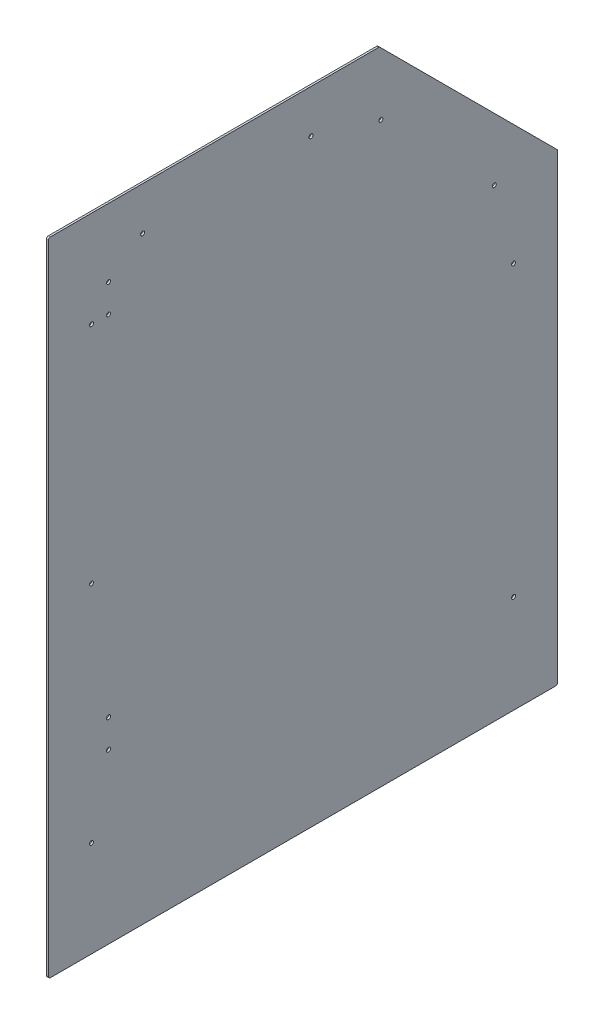
ISO-10303-21;
HEADER;
FILE_DESCRIPTION(('STEP AP214'),'2;1');
FILE_NAME('part.step','',(''),(''),'','','');
FILE_SCHEMA(('AUTOMOTIVE_DESIGN { 1 0 10303 214 1 1 1 1 }'));
ENDSEC;
DATA;
#1=APPLICATION_CONTEXT('core data for automotive mechanical design processes');
#2=APPLICATION_PROTOCOL_DEFINITION('international standard','automotive_design',2000,#1);
#3=PRODUCT_CONTEXT('',#1,'mechanical');
#4=PRODUCT('Part','Part','',(#3));
#5=PRODUCT_RELATED_PRODUCT_CATEGORY('part','',(#4));
#6=PRODUCT_DEFINITION_FORMATION('','',#4);
#7=PRODUCT_DEFINITION_CONTEXT('part definition',#1,'design');
#8=PRODUCT_DEFINITION('design','',#6,#7);
#9=PRODUCT_DEFINITION_SHAPE('','',#8);
#10=(LENGTH_UNIT() NAMED_UNIT(*) SI_UNIT(.MILLI.,.METRE.));
#11=(NAMED_UNIT(*) PLANE_ANGLE_UNIT() SI_UNIT($,.RADIAN.));
#12=(NAMED_UNIT(*) SI_UNIT($,.STERADIAN.) SOLID_ANGLE_UNIT());
#13=UNCERTAINTY_MEASURE_WITH_UNIT(LENGTH_MEASURE(1.E-05),#10,'distance_accuracy_value','');
#14=(GEOMETRIC_REPRESENTATION_CONTEXT(3) GLOBAL_UNCERTAINTY_ASSIGNED_CONTEXT((#13)) GLOBAL_UNIT_ASSIGNED_CONTEXT((#10,
#11,#12)) REPRESENTATION_CONTEXT('',''));
#15=CARTESIAN_POINT('',(0.,0.,0.));
#16=DIRECTION('',(0.,0.,1.));
#17=DIRECTION('',(1.,0.,0.));
#18=AXIS2_PLACEMENT_3D('',#15,#16,#17);
#19=CARTESIAN_POINT('',(0.,0.,0.));
#20=DIRECTION('',(-1.,0.,0.));
#21=DIRECTION('',(0.,0.,1.));
#22=AXIS2_PLACEMENT_3D('',#19,#20,#21);
#23=PLANE('',#22);
#24=CARTESIAN_POINT('',(0.,152.4,-68.2625000000001));
#25=DIRECTION('',(1.,0.,0.));
#26=DIRECTION('',(0.,0.,-1.));
#27=AXIS2_PLACEMENT_3D('',#24,#25,#26);
#28=CIRCLE('',#27,3.17499999999998);
#29=CARTESIAN_POINT('',(0.,152.4,-71.4375000000001));
#30=VERTEX_POINT('',#29);
#31=EDGE_CURVE('E283',#30,#30,#28,.T.);
#32=ORIENTED_EDGE('',*,*,#31,.T.);
#33=EDGE_LOOP('',(#32));
#34=FACE_BOUND('',#33,.T.);
#35=CARTESIAN_POINT('',(0.,508.,-68.2625000000001));
#36=DIRECTION('',(1.,0.,0.));
#37=DIRECTION('',(0.,0.,-1.));
#38=AXIS2_PLACEMENT_3D('',#35,#36,#37);
#39=CIRCLE('',#38,3.17500000000004);
#40=CARTESIAN_POINT('',(0.,508.,-71.4375000000002));
#41=VERTEX_POINT('',#40);
#42=EDGE_CURVE('E277',#41,#41,#39,.T.);
#43=ORIENTED_EDGE('',*,*,#42,.T.);
#44=EDGE_LOOP('',(#43));
#45=FACE_BOUND('',#44,.T.);
#46=CARTESIAN_POINT('',(0.,863.6,-68.2625000000001));
#47=DIRECTION('',(1.,0.,0.));
#48=DIRECTION('',(0.,0.,-1.));
#49=AXIS2_PLACEMENT_3D('',#46,#47,#48);
#50=CIRCLE('',#49,3.17500000000004);
#51=CARTESIAN_POINT('',(0.,863.6,-71.4375000000002));
#52=VERTEX_POINT('',#51);
#53=EDGE_CURVE('E271',#52,#52,#50,.T.);
#54=ORIENTED_EDGE('',*,*,#53,.T.);
#55=EDGE_LOOP('',(#54));
#56=FACE_BOUND('',#55,.T.);
#57=CARTESIAN_POINT('',(0.,947.7375,-149.225));
#58=DIRECTION('',(1.,0.,0.));
#59=DIRECTION('',(0.,0.,-1.));
#60=AXIS2_PLACEMENT_3D('',#57,#58,#59);
#61=CIRCLE('',#60,3.17500000000004);
#62=CARTESIAN_POINT('',(0.,947.7375,-152.4));
#63=VERTEX_POINT('',#62);
#64=EDGE_CURVE('E265',#63,#63,#61,.T.);
#65=ORIENTED_EDGE('',*,*,#64,.T.);
#66=EDGE_LOOP('',(#65));
#67=FACE_BOUND('',#66,.T.);
#68=DIRECTION('',(0.,-1.,0.));
#69=VECTOR('',#68,1.);
#70=CARTESIAN_POINT('',(0.,0.,0.));
#71=LINE('',#70,#69);
#72=CARTESIAN_POINT('',(0.,1012.825,0.));
#73=VERTEX_POINT('',#72);
#74=CARTESIAN_POINT('',(0.,3.175,0.));
#75=VERTEX_POINT('',#74);
#76=EDGE_CURVE('E130',#73,#75,#71,.T.);
#77=ORIENTED_EDGE('',*,*,#76,.F.);
#78=CARTESIAN_POINT('',(0.,1012.825,-3.175));
#79=DIRECTION('',(-1.,0.,0.));
#80=DIRECTION('',(0.,0.,1.));
#81=AXIS2_PLACEMENT_3D('',#78,#79,#80);
#82=CIRCLE('',#81,3.175);
#83=CARTESIAN_POINT('',(0.,1016.,-3.175));
#84=VERTEX_POINT('',#83);
#85=EDGE_CURVE('E113',#73,#84,#82,.T.);
#86=ORIENTED_EDGE('',*,*,#85,.T.);
#87=DIRECTION('',(0.,0.,1.));
#88=VECTOR('',#87,1.);
#89=CARTESIAN_POINT('',(0.,1016.,0.));
#90=LINE('',#89,#88);
#91=CARTESIAN_POINT('',(0.,1016.,-522.917689271223));
#92=VERTEX_POINT('',#91);
#93=EDGE_CURVE('E140',#92,#84,#90,.T.);
#94=ORIENTED_EDGE('',*,*,#93,.F.);
#95=CARTESIAN_POINT('',(0.,1012.825,-522.917689271223));
#96=DIRECTION('',(-1.,0.,0.));
#97=DIRECTION('',(0.,0.,1.));
#98=AXIS2_PLACEMENT_3D('',#95,#96,#97);
#99=CIRCLE('',#98,3.175);
#100=CARTESIAN_POINT('',(0.,1015.07006403027,-525.16275330149));
#101=VERTEX_POINT('',#100);
#102=EDGE_CURVE('E124',#92,#101,#99,.T.);
#103=ORIENTED_EDGE('',*,*,#102,.T.);
#104=DIRECTION('',(0.,0.707106781186544,0.707106781186552));
#105=VECTOR('',#104,1.);
#106=CARTESIAN_POINT('',(0.,1016.,-524.232817331758));
#107=LINE('',#106,#105);
#108=CARTESIAN_POINT('',(0.,734.712753301493,-805.520064030267));
#109=VERTEX_POINT('',#108);
#110=EDGE_CURVE('E145',#109,#101,#107,.T.);
#111=ORIENTED_EDGE('',*,*,#110,.F.);
#112=CARTESIAN_POINT('',(0.,732.467689271226,-803.275));
#113=DIRECTION('',(-1.,0.,0.));
#114=DIRECTION('',(0.,0.,1.));
#115=AXIS2_PLACEMENT_3D('',#112,#113,#114);
#116=CIRCLE('',#115,3.175);
#117=CARTESIAN_POINT('',(0.,732.467689271226,-806.45));
#118=VERTEX_POINT('',#117);
#119=EDGE_CURVE('E153',#109,#118,#116,.T.);
#120=ORIENTED_EDGE('',*,*,#119,.T.);
#121=DIRECTION('',(0.,1.,0.));
#122=VECTOR('',#121,1.);
#123=CARTESIAN_POINT('',(0.,733.782817331761,-806.45));
#124=LINE('',#123,#122);
#125=CARTESIAN_POINT('',(0.,3.17500000000004,-806.45));
#126=VERTEX_POINT('',#125);
#127=EDGE_CURVE('E187',#126,#118,#124,.T.);
#128=ORIENTED_EDGE('',*,*,#127,.F.);
#129=CARTESIAN_POINT('',(0.,3.17500000000004,-803.275));
#130=DIRECTION('',(-1.,0.,0.));
#131=DIRECTION('',(0.,0.,1.));
#132=AXIS2_PLACEMENT_3D('',#129,#130,#131);
#133=CIRCLE('',#132,3.175);
#134=CARTESIAN_POINT('',(0.,0.,-803.275));
#135=VERTEX_POINT('',#134);
#136=EDGE_CURVE('E151',#126,#135,#133,.T.);
#137=ORIENTED_EDGE('',*,*,#136,.T.);
#138=DIRECTION('',(0.,0.,-1.));
#139=VECTOR('',#138,1.);
#140=CARTESIAN_POINT('',(0.,0.,-806.45));
#141=LINE('',#140,#139);
#142=CARTESIAN_POINT('',(0.,0.,-3.17500000000004));
#143=VERTEX_POINT('',#142);
#144=EDGE_CURVE('E182',#143,#135,#141,.T.);
#145=ORIENTED_EDGE('',*,*,#144,.F.);
#146=CARTESIAN_POINT('',(0.,3.175,-3.17500000000004));
#147=DIRECTION('',(-1.,0.,0.));
#148=DIRECTION('',(0.,0.,1.));
#149=AXIS2_PLACEMENT_3D('',#146,#147,#148);
#150=CIRCLE('',#149,3.175);
#151=EDGE_CURVE('E134',#143,#75,#150,.T.);
#152=ORIENTED_EDGE('',*,*,#151,.T.);
#153=EDGE_LOOP('',(#77,#86,#94,#103,#111,#120,#128,#137,#145,#152));
#154=FACE_BOUND('',#153,.T.);
#155=CARTESIAN_POINT('',(0.,908.05,-95.2499999999979));
#156=DIRECTION('',(1.,0.,0.));
#157=DIRECTION('',(0.,0.,-1.));
#158=AXIS2_PLACEMENT_3D('',#155,#156,#157);
#159=CIRCLE('',#158,3.17500000000004);
#160=CARTESIAN_POINT('',(0.,908.05,-98.424999999998));
#161=VERTEX_POINT('',#160);
#162=EDGE_CURVE('E188',#161,#161,#159,.T.);
#163=ORIENTED_EDGE('',*,*,#162,.T.);
#164=EDGE_LOOP('',(#163));
#165=FACE_BOUND('',#164,.T.);
#166=CARTESIAN_POINT('',(0.,863.6,-95.2499999999997));
#167=DIRECTION('',(1.,0.,0.));
#168=DIRECTION('',(0.,0.,-1.));
#169=AXIS2_PLACEMENT_3D('',#166,#167,#168);
#170=CIRCLE('',#169,3.17500000000004);
#171=CARTESIAN_POINT('',(0.,863.6,-98.4249999999997));
#172=VERTEX_POINT('',#171);
#173=EDGE_CURVE('E217',#172,#172,#170,.T.);
#174=ORIENTED_EDGE('',*,*,#173,.T.);
#175=EDGE_LOOP('',(#174));
#176=FACE_BOUND('',#175,.T.);
#177=CARTESIAN_POINT('',(0.,311.15,-95.25));
#178=DIRECTION('',(1.,0.,0.));
#179=DIRECTION('',(0.,0.,-1.));
#180=AXIS2_PLACEMENT_3D('',#177,#178,#179);
#181=CIRCLE('',#180,3.17499999999998);
#182=CARTESIAN_POINT('',(0.,311.15,-98.425));
#183=VERTEX_POINT('',#182);
#184=EDGE_CURVE('E223',#183,#183,#181,.T.);
#185=ORIENTED_EDGE('',*,*,#184,.T.);
#186=EDGE_LOOP('',(#185));
#187=FACE_BOUND('',#186,.T.);
#188=CARTESIAN_POINT('',(0.,266.7,-95.25));
#189=DIRECTION('',(1.,0.,0.));
#190=DIRECTION('',(0.,0.,-1.));
#191=AXIS2_PLACEMENT_3D('',#188,#189,#190);
#192=CIRCLE('',#191,3.17499999999998);
#193=CARTESIAN_POINT('',(0.,266.7,-98.425));
#194=VERTEX_POINT('',#193);
#195=EDGE_CURVE('E229',#194,#194,#192,.T.);
#196=ORIENTED_EDGE('',*,*,#195,.T.);
#197=EDGE_LOOP('',(#196));
#198=FACE_BOUND('',#197,.T.);
#199=CARTESIAN_POINT('',(0.,914.924172517765,-526.525827482232));
#200=DIRECTION('',(1.,0.,0.));
#201=DIRECTION('',(0.,0.,-1.));
#202=AXIS2_PLACEMENT_3D('',#199,#200,#201);
#203=CIRCLE('',#202,3.17500000000004);
#204=CARTESIAN_POINT('',(0.,914.924172517765,-529.700827482232));
#205=VERTEX_POINT('',#204);
#206=EDGE_CURVE('E235',#205,#205,#203,.T.);
#207=ORIENTED_EDGE('',*,*,#206,.T.);
#208=EDGE_LOOP('',(#207));
#209=FACE_BOUND('',#208,.T.);
#210=CARTESIAN_POINT('',(0.,735.319050096383,-706.130949903616));
#211=DIRECTION('',(1.,0.,0.));
#212=DIRECTION('',(0.,0.,-1.));
#213=AXIS2_PLACEMENT_3D('',#210,#211,#212);
#214=CIRCLE('',#213,3.17500000000004);
#215=CARTESIAN_POINT('',(0.,735.319050096383,-709.305949903616));
#216=VERTEX_POINT('',#215);
#217=EDGE_CURVE('E241',#216,#216,#214,.T.);
#218=ORIENTED_EDGE('',*,*,#217,.T.);
#219=EDGE_LOOP('',(#218));
#220=FACE_BOUND('',#219,.T.);
#221=CARTESIAN_POINT('',(0.,612.775,-736.6));
#222=DIRECTION('',(1.,0.,0.));
#223=DIRECTION('',(0.,0.,-1.));
#224=AXIS2_PLACEMENT_3D('',#221,#222,#223);
#225=CIRCLE('',#224,3.17500000000004);
#226=CARTESIAN_POINT('',(0.,612.775,-739.775));
#227=VERTEX_POINT('',#226);
#228=EDGE_CURVE('E247',#227,#227,#225,.T.);
#229=ORIENTED_EDGE('',*,*,#228,.T.);
#230=EDGE_LOOP('',(#229));
#231=FACE_BOUND('',#230,.T.);
#232=CARTESIAN_POINT('',(0.,155.575,-736.6));
#233=DIRECTION('',(1.,0.,0.));
#234=DIRECTION('',(0.,0.,-1.));
#235=AXIS2_PLACEMENT_3D('',#232,#233,#234);
#236=CIRCLE('',#235,3.17499999999998);
#237=CARTESIAN_POINT('',(0.,155.575,-739.775));
#238=VERTEX_POINT('',#237);
#239=EDGE_CURVE('E253',#238,#238,#236,.T.);
#240=ORIENTED_EDGE('',*,*,#239,.T.);
#241=EDGE_LOOP('',(#240));
#242=FACE_BOUND('',#241,.T.);
#243=CARTESIAN_POINT('',(0.,947.7375,-415.925));
#244=DIRECTION('',(1.,0.,0.));
#245=DIRECTION('',(0.,0.,-1.));
#246=AXIS2_PLACEMENT_3D('',#243,#244,#245);
#247=CIRCLE('',#246,3.17500000000004);
#248=CARTESIAN_POINT('',(0.,947.7375,-419.1));
#249=VERTEX_POINT('',#248);
#250=EDGE_CURVE('E259',#249,#249,#247,.T.);
#251=ORIENTED_EDGE('',*,*,#250,.T.);
#252=EDGE_LOOP('',(#251));
#253=FACE_BOUND('',#252,.T.);
#254=ADVANCED_FACE('F35',(#34,#45,#56,#67,#154,#165,#176,#187,#198,#209,#220,#231,#242,#253),
#23,.T.);
#255=CARTESIAN_POINT('',(3.175,0.,0.));
#256=DIRECTION('',(-1.,0.,0.));
#257=DIRECTION('',(0.,0.,1.));
#258=AXIS2_PLACEMENT_3D('',#255,#256,#257);
#259=PLANE('',#258);
#260=CARTESIAN_POINT('',(3.175,152.4,-68.2625000000001));
#261=DIRECTION('',(1.,0.,0.));
#262=DIRECTION('',(0.,0.,-1.));
#263=AXIS2_PLACEMENT_3D('',#260,#261,#262);
#264=CIRCLE('',#263,3.17499999999998);
#265=CARTESIAN_POINT('',(3.175,152.4,-71.4375000000001));
#266=VERTEX_POINT('',#265);
#267=EDGE_CURVE('E286',#266,#266,#264,.T.);
#268=ORIENTED_EDGE('',*,*,#267,.F.);
#269=EDGE_LOOP('',(#268));
#270=FACE_BOUND('',#269,.T.);
#271=CARTESIAN_POINT('',(3.175,508.,-68.2625000000001));
#272=DIRECTION('',(1.,0.,0.));
#273=DIRECTION('',(0.,0.,-1.));
#274=AXIS2_PLACEMENT_3D('',#271,#272,#273);
#275=CIRCLE('',#274,3.17500000000004);
#276=CARTESIAN_POINT('',(3.175,508.,-71.4375000000002));
#277=VERTEX_POINT('',#276);
#278=EDGE_CURVE('E280',#277,#277,#275,.T.);
#279=ORIENTED_EDGE('',*,*,#278,.F.);
#280=EDGE_LOOP('',(#279));
#281=FACE_BOUND('',#280,.T.);
#282=CARTESIAN_POINT('',(3.175,863.6,-68.2625000000001));
#283=DIRECTION('',(1.,0.,0.));
#284=DIRECTION('',(0.,0.,-1.));
#285=AXIS2_PLACEMENT_3D('',#282,#283,#284);
#286=CIRCLE('',#285,3.17500000000004);
#287=CARTESIAN_POINT('',(3.175,863.6,-71.4375000000002));
#288=VERTEX_POINT('',#287);
#289=EDGE_CURVE('E274',#288,#288,#286,.T.);
#290=ORIENTED_EDGE('',*,*,#289,.F.);
#291=EDGE_LOOP('',(#290));
#292=FACE_BOUND('',#291,.T.);
#293=CARTESIAN_POINT('',(3.175,947.7375,-149.225));
#294=DIRECTION('',(1.,0.,0.));
#295=DIRECTION('',(0.,0.,-1.));
#296=AXIS2_PLACEMENT_3D('',#293,#294,#295);
#297=CIRCLE('',#296,3.17500000000004);
#298=CARTESIAN_POINT('',(3.175,947.7375,-152.4));
#299=VERTEX_POINT('',#298);
#300=EDGE_CURVE('E268',#299,#299,#297,.T.);
#301=ORIENTED_EDGE('',*,*,#300,.F.);
#302=EDGE_LOOP('',(#301));
#303=FACE_BOUND('',#302,.T.);
#304=CARTESIAN_POINT('',(3.175,947.7375,-415.925));
#305=DIRECTION('',(1.,0.,0.));
#306=DIRECTION('',(0.,0.,-1.));
#307=AXIS2_PLACEMENT_3D('',#304,#305,#306);
#308=CIRCLE('',#307,3.17500000000004);
#309=CARTESIAN_POINT('',(3.175,947.7375,-419.1));
#310=VERTEX_POINT('',#309);
#311=EDGE_CURVE('E262',#310,#310,#308,.T.);
#312=ORIENTED_EDGE('',*,*,#311,.F.);
#313=EDGE_LOOP('',(#312));
#314=FACE_BOUND('',#313,.T.);
#315=CARTESIAN_POINT('',(3.175,155.575,-736.6));
#316=DIRECTION('',(1.,0.,0.));
#317=DIRECTION('',(0.,0.,-1.));
#318=AXIS2_PLACEMENT_3D('',#315,#316,#317);
#319=CIRCLE('',#318,3.17499999999998);
#320=CARTESIAN_POINT('',(3.175,155.575,-739.775));
#321=VERTEX_POINT('',#320);
#322=EDGE_CURVE('E256',#321,#321,#319,.T.);
#323=ORIENTED_EDGE('',*,*,#322,.F.);
#324=EDGE_LOOP('',(#323));
#325=FACE_BOUND('',#324,.T.);
#326=CARTESIAN_POINT('',(3.175,735.319050096383,-706.130949903616));
#327=DIRECTION('',(1.,0.,0.));
#328=DIRECTION('',(0.,0.,-1.));
#329=AXIS2_PLACEMENT_3D('',#326,#327,#328);
#330=CIRCLE('',#329,3.17500000000004);
#331=CARTESIAN_POINT('',(3.175,735.319050096383,-709.305949903616));
#332=VERTEX_POINT('',#331);
#333=EDGE_CURVE('E244',#332,#332,#330,.T.);
#334=ORIENTED_EDGE('',*,*,#333,.F.);
#335=EDGE_LOOP('',(#334));
#336=FACE_BOUND('',#335,.T.);
#337=CARTESIAN_POINT('',(3.175,914.924172517765,-526.525827482232));
#338=DIRECTION('',(1.,0.,0.));
#339=DIRECTION('',(0.,0.,-1.));
#340=AXIS2_PLACEMENT_3D('',#337,#338,#339);
#341=CIRCLE('',#340,3.17500000000004);
#342=CARTESIAN_POINT('',(3.175,914.924172517765,-529.700827482232));
#343=VERTEX_POINT('',#342);
#344=EDGE_CURVE('E238',#343,#343,#341,.T.);
#345=ORIENTED_EDGE('',*,*,#344,.F.);
#346=EDGE_LOOP('',(#345));
#347=FACE_BOUND('',#346,.T.);
#348=CARTESIAN_POINT('',(3.175,266.7,-95.25));
#349=DIRECTION('',(1.,0.,0.));
#350=DIRECTION('',(0.,0.,-1.));
#351=AXIS2_PLACEMENT_3D('',#348,#349,#350);
#352=CIRCLE('',#351,3.17499999999998);
#353=CARTESIAN_POINT('',(3.175,266.7,-98.425));
#354=VERTEX_POINT('',#353);
#355=EDGE_CURVE('E232',#354,#354,#352,.T.);
#356=ORIENTED_EDGE('',*,*,#355,.F.);
#357=EDGE_LOOP('',(#356));
#358=FACE_BOUND('',#357,.T.);
#359=CARTESIAN_POINT('',(3.175,311.15,-95.25));
#360=DIRECTION('',(1.,0.,0.));
#361=DIRECTION('',(0.,0.,-1.));
#362=AXIS2_PLACEMENT_3D('',#359,#360,#361);
#363=CIRCLE('',#362,3.17499999999998);
#364=CARTESIAN_POINT('',(3.175,311.15,-98.425));
#365=VERTEX_POINT('',#364);
#366=EDGE_CURVE('E226',#365,#365,#363,.T.);
#367=ORIENTED_EDGE('',*,*,#366,.F.);
#368=EDGE_LOOP('',(#367));
#369=FACE_BOUND('',#368,.T.);
#370=CARTESIAN_POINT('',(3.175,863.6,-95.2499999999997));
#371=DIRECTION('',(1.,0.,0.));
#372=DIRECTION('',(0.,0.,-1.));
#373=AXIS2_PLACEMENT_3D('',#370,#371,#372);
#374=CIRCLE('',#373,3.17500000000004);
#375=CARTESIAN_POINT('',(3.175,863.6,-98.4249999999997));
#376=VERTEX_POINT('',#375);
#377=EDGE_CURVE('E220',#376,#376,#374,.T.);
#378=ORIENTED_EDGE('',*,*,#377,.F.);
#379=EDGE_LOOP('',(#378));
#380=FACE_BOUND('',#379,.T.);
#381=CARTESIAN_POINT('',(3.175,908.05,-95.2499999999979));
#382=DIRECTION('',(1.,0.,0.));
#383=DIRECTION('',(0.,0.,-1.));
#384=AXIS2_PLACEMENT_3D('',#381,#382,#383);
#385=CIRCLE('',#384,3.17500000000004);
#386=CARTESIAN_POINT('',(3.175,908.05,-98.424999999998));
#387=VERTEX_POINT('',#386);
#388=EDGE_CURVE('E193',#387,#387,#385,.T.);
#389=ORIENTED_EDGE('',*,*,#388,.F.);
#390=EDGE_LOOP('',(#389));
#391=FACE_BOUND('',#390,.T.);
#392=DIRECTION('',(0.,0.,1.));
#393=VECTOR('',#392,1.);
#394=CARTESIAN_POINT('',(3.175,1016.,0.));
#395=LINE('',#394,#393);
#396=CARTESIAN_POINT('',(3.175,1016.,-522.917689271223));
#397=VERTEX_POINT('',#396);
#398=CARTESIAN_POINT('',(3.175,1016.,-3.175));
#399=VERTEX_POINT('',#398);
#400=EDGE_CURVE('E208',#397,#399,#395,.T.);
#401=ORIENTED_EDGE('',*,*,#400,.T.);
#402=CARTESIAN_POINT('',(3.175,1012.825,-3.175));
#403=DIRECTION('',(-1.,0.,0.));
#404=DIRECTION('',(0.,0.,1.));
#405=AXIS2_PLACEMENT_3D('',#402,#403,#404);
#406=CIRCLE('',#405,3.175);
#407=CARTESIAN_POINT('',(3.175,1012.825,0.));
#408=VERTEX_POINT('',#407);
#409=EDGE_CURVE('E166',#399,#408,#406,.F.);
#410=ORIENTED_EDGE('',*,*,#409,.T.);
#411=DIRECTION('',(0.,-1.,0.));
#412=VECTOR('',#411,1.);
#413=CARTESIAN_POINT('',(3.175,0.,0.));
#414=LINE('',#413,#412);
#415=CARTESIAN_POINT('',(3.175,3.175,0.));
#416=VERTEX_POINT('',#415);
#417=EDGE_CURVE('E133',#408,#416,#414,.T.);
#418=ORIENTED_EDGE('',*,*,#417,.T.);
#419=CARTESIAN_POINT('',(3.175,3.175,-3.17500000000004));
#420=DIRECTION('',(-1.,0.,0.));
#421=DIRECTION('',(0.,0.,1.));
#422=AXIS2_PLACEMENT_3D('',#419,#420,#421);
#423=CIRCLE('',#422,3.175);
#424=CARTESIAN_POINT('',(3.175,0.,-3.17500000000004));
#425=VERTEX_POINT('',#424);
#426=EDGE_CURVE('E159',#416,#425,#423,.F.);
#427=ORIENTED_EDGE('',*,*,#426,.T.);
#428=DIRECTION('',(0.,0.,-1.));
#429=VECTOR('',#428,1.);
#430=CARTESIAN_POINT('',(3.175,0.,-806.45));
#431=LINE('',#430,#429);
#432=CARTESIAN_POINT('',(3.175,0.,-803.275));
#433=VERTEX_POINT('',#432);
#434=EDGE_CURVE('E139',#425,#433,#431,.T.);
#435=ORIENTED_EDGE('',*,*,#434,.T.);
#436=CARTESIAN_POINT('',(3.175,3.17500000000004,-803.275));
#437=DIRECTION('',(-1.,0.,0.));
#438=DIRECTION('',(0.,0.,1.));
#439=AXIS2_PLACEMENT_3D('',#436,#437,#438);
#440=CIRCLE('',#439,3.175);
#441=CARTESIAN_POINT('',(3.175,3.17500000000004,-806.45));
#442=VERTEX_POINT('',#441);
#443=EDGE_CURVE('E161',#433,#442,#440,.F.);
#444=ORIENTED_EDGE('',*,*,#443,.T.);
#445=DIRECTION('',(0.,1.,0.));
#446=VECTOR('',#445,1.);
#447=CARTESIAN_POINT('',(3.175,733.782817331761,-806.45));
#448=LINE('',#447,#446);
#449=CARTESIAN_POINT('',(3.175,732.467689271226,-806.45));
#450=VERTEX_POINT('',#449);
#451=EDGE_CURVE('E143',#442,#450,#448,.T.);
#452=ORIENTED_EDGE('',*,*,#451,.T.);
#453=CARTESIAN_POINT('',(3.175,732.467689271226,-803.275));
#454=DIRECTION('',(-1.,0.,0.));
#455=DIRECTION('',(0.,0.,1.));
#456=AXIS2_PLACEMENT_3D('',#453,#454,#455);
#457=CIRCLE('',#456,3.175);
#458=CARTESIAN_POINT('',(3.175,734.712753301493,-805.520064030267));
#459=VERTEX_POINT('',#458);
#460=EDGE_CURVE('E57',#450,#459,#457,.F.);
#461=ORIENTED_EDGE('',*,*,#460,.T.);
#462=DIRECTION('',(0.,0.707106781186544,0.707106781186552));
#463=VECTOR('',#462,1.);
#464=CARTESIAN_POINT('',(3.175,1016.,-524.232817331758));
#465=LINE('',#464,#463);
#466=CARTESIAN_POINT('',(3.175,1015.07006403027,-525.16275330149));
#467=VERTEX_POINT('',#466);
#468=EDGE_CURVE('E209',#459,#467,#465,.T.);
#469=ORIENTED_EDGE('',*,*,#468,.T.);
#470=CARTESIAN_POINT('',(3.175,1012.825,-522.917689271223));
#471=DIRECTION('',(-1.,0.,0.));
#472=DIRECTION('',(0.,0.,1.));
#473=AXIS2_PLACEMENT_3D('',#470,#471,#472);
#474=CIRCLE('',#473,3.175);
#475=EDGE_CURVE('E164',#467,#397,#474,.F.);
#476=ORIENTED_EDGE('',*,*,#475,.T.);
#477=EDGE_LOOP('',(#401,#410,#418,#427,#435,#444,#452,#461,#469,#476));
#478=FACE_BOUND('',#477,.T.);
#479=CARTESIAN_POINT('',(3.175,612.775,-736.6));
#480=DIRECTION('',(1.,0.,0.));
#481=DIRECTION('',(0.,0.,-1.));
#482=AXIS2_PLACEMENT_3D('',#479,#480,#481);
#483=CIRCLE('',#482,3.17500000000004);
#484=CARTESIAN_POINT('',(3.175,612.775,-739.775));
#485=VERTEX_POINT('',#484);
#486=EDGE_CURVE('E250',#485,#485,#483,.T.);
#487=ORIENTED_EDGE('',*,*,#486,.F.);
#488=EDGE_LOOP('',(#487));
#489=FACE_BOUND('',#488,.T.);
#490=ADVANCED_FACE('F206',(#270,#281,#292,#303,#314,#325,#336,#347,#358,#369,#380,#391,#478,
#489),#259,.F.);
#491=CARTESIAN_POINT('',(3.175,0.,-806.45));
#492=DIRECTION('',(0.,1.,0.));
#493=DIRECTION('',(0.,0.,1.));
#494=AXIS2_PLACEMENT_3D('',#491,#492,#493);
#495=PLANE('',#494);
#496=ORIENTED_EDGE('',*,*,#144,.T.);
#497=DIRECTION('',(-1.,0.,0.));
#498=VECTOR('',#497,1.);
#499=CARTESIAN_POINT('',(3.175,0.,-803.275));
#500=LINE('',#499,#498);
#501=EDGE_CURVE('E11',#135,#433,#500,.F.);
#502=ORIENTED_EDGE('',*,*,#501,.T.);
#503=ORIENTED_EDGE('',*,*,#434,.F.);
#504=DIRECTION('',(-1.,0.,0.));
#505=VECTOR('',#504,1.);
#506=CARTESIAN_POINT('',(3.175,0.,-3.17500000000004));
#507=LINE('',#506,#505);
#508=EDGE_CURVE('E43',#425,#143,#507,.T.);
#509=ORIENTED_EDGE('',*,*,#508,.T.);
#510=EDGE_LOOP('',(#496,#502,#503,#509));
#511=FACE_BOUND('',#510,.T.);
#512=ADVANCED_FACE('F181',(#511),#495,.F.);
#513=CARTESIAN_POINT('',(3.175,733.782817331761,-806.45));
#514=DIRECTION('',(0.,0.,1.));
#515=DIRECTION('',(1.,0.,0.));
#516=AXIS2_PLACEMENT_3D('',#513,#514,#515);
#517=PLANE('',#516);
#518=ORIENTED_EDGE('',*,*,#127,.T.);
#519=DIRECTION('',(-1.,0.,0.));
#520=VECTOR('',#519,1.);
#521=CARTESIAN_POINT('',(3.175,732.467689271226,-806.45));
#522=LINE('',#521,#520);
#523=EDGE_CURVE('E175',#118,#450,#522,.F.);
#524=ORIENTED_EDGE('',*,*,#523,.T.);
#525=ORIENTED_EDGE('',*,*,#451,.F.);
#526=DIRECTION('',(-1.,0.,0.));
#527=VECTOR('',#526,1.);
#528=CARTESIAN_POINT('',(3.175,3.17500000000004,-806.45));
#529=LINE('',#528,#527);
#530=EDGE_CURVE('E172',#442,#126,#529,.T.);
#531=ORIENTED_EDGE('',*,*,#530,.T.);
#532=EDGE_LOOP('',(#518,#524,#525,#531));
#533=FACE_BOUND('',#532,.T.);
#534=ADVANCED_FACE('F342',(#533),#517,.F.);
#535=CARTESIAN_POINT('',(3.175,1016.,-524.232817331758));
#536=DIRECTION('',(0.,-0.707106781186551,0.707106781186543));
#537=DIRECTION('',(0.,-0.707106781186544,-0.707106781186551));
#538=AXIS2_PLACEMENT_3D('',#535,#536,#537);
#539=PLANE('',#538);
#540=ORIENTED_EDGE('',*,*,#110,.T.);
#541=DIRECTION('',(-1.,0.,0.));
#542=VECTOR('',#541,1.);
#543=CARTESIAN_POINT('',(3.175,1015.07006403027,-525.16275330149));
#544=LINE('',#543,#542);
#545=EDGE_CURVE('E50',#101,#467,#544,.F.);
#546=ORIENTED_EDGE('',*,*,#545,.T.);
#547=ORIENTED_EDGE('',*,*,#468,.F.);
#548=DIRECTION('',(-1.,0.,0.));
#549=VECTOR('',#548,1.);
#550=CARTESIAN_POINT('',(3.175,734.712753301493,-805.520064030267));
#551=LINE('',#550,#549);
#552=EDGE_CURVE('E168',#459,#109,#551,.T.);
#553=ORIENTED_EDGE('',*,*,#552,.T.);
#554=EDGE_LOOP('',(#540,#546,#547,#553));
#555=FACE_BOUND('',#554,.T.);
#556=ADVANCED_FACE('F198',(#555),#539,.F.);
#557=CARTESIAN_POINT('',(3.175,1016.,0.));
#558=DIRECTION('',(0.,-1.,0.));
#559=DIRECTION('',(0.,0.,-1.));
#560=AXIS2_PLACEMENT_3D('',#557,#558,#559);
#561=PLANE('',#560);
#562=ORIENTED_EDGE('',*,*,#93,.T.);
#563=DIRECTION('',(-1.,0.,0.));
#564=VECTOR('',#563,1.);
#565=CARTESIAN_POINT('',(3.175,1016.,-3.175));
#566=LINE('',#565,#564);
#567=EDGE_CURVE('E118',#84,#399,#566,.F.);
#568=ORIENTED_EDGE('',*,*,#567,.T.);
#569=ORIENTED_EDGE('',*,*,#400,.F.);
#570=DIRECTION('',(-1.,0.,0.));
#571=VECTOR('',#570,1.);
#572=CARTESIAN_POINT('',(3.175,1016.,-522.917689271223));
#573=LINE('',#572,#571);
#574=EDGE_CURVE('E123',#397,#92,#573,.T.);
#575=ORIENTED_EDGE('',*,*,#574,.T.);
#576=EDGE_LOOP('',(#562,#568,#569,#575));
#577=FACE_BOUND('',#576,.T.);
#578=ADVANCED_FACE('F211',(#577),#561,.F.);
#579=CARTESIAN_POINT('',(3.175,0.,0.));
#580=DIRECTION('',(0.,0.,-1.));
#581=DIRECTION('',(-1.,0.,0.));
#582=AXIS2_PLACEMENT_3D('',#579,#580,#581);
#583=PLANE('',#582);
#584=ORIENTED_EDGE('',*,*,#417,.F.);
#585=DIRECTION('',(-1.,0.,0.));
#586=VECTOR('',#585,1.);
#587=CARTESIAN_POINT('',(3.175,1012.825,0.));
#588=LINE('',#587,#586);
#589=EDGE_CURVE('E117',#408,#73,#588,.T.);
#590=ORIENTED_EDGE('',*,*,#589,.T.);
#591=ORIENTED_EDGE('',*,*,#76,.T.);
#592=DIRECTION('',(-1.,0.,0.));
#593=VECTOR('',#592,1.);
#594=CARTESIAN_POINT('',(3.175,3.175,0.));
#595=LINE('',#594,#593);
#596=EDGE_CURVE('E135',#75,#416,#595,.F.);
#597=ORIENTED_EDGE('',*,*,#596,.T.);
#598=EDGE_LOOP('',(#584,#590,#591,#597));
#599=FACE_BOUND('',#598,.T.);
#600=ADVANCED_FACE('F129',(#599),#583,.F.);
#601=CARTESIAN_POINT('',(3.175,908.05,-95.2499999999979));
#602=DIRECTION('',(1.,0.,0.));
#603=DIRECTION('',(0.,0.,-1.));
#604=AXIS2_PLACEMENT_3D('',#601,#602,#603);
#605=CYLINDRICAL_SURFACE('',#604,3.17500000000004);
#606=ORIENTED_EDGE('',*,*,#162,.F.);
#607=EDGE_LOOP('',(#606));
#608=FACE_BOUND('',#607,.T.);
#609=ORIENTED_EDGE('',*,*,#388,.T.);
#610=EDGE_LOOP('',(#609));
#611=FACE_BOUND('',#610,.T.);
#612=ADVANCED_FACE('F317',(#608,#611),#605,.F.);
#613=CARTESIAN_POINT('',(3.175,863.6,-95.2499999999997));
#614=DIRECTION('',(1.,0.,0.));
#615=DIRECTION('',(0.,0.,-1.));
#616=AXIS2_PLACEMENT_3D('',#613,#614,#615);
#617=CYLINDRICAL_SURFACE('',#616,3.17500000000004);
#618=ORIENTED_EDGE('',*,*,#173,.F.);
#619=EDGE_LOOP('',(#618));
#620=FACE_BOUND('',#619,.T.);
#621=ORIENTED_EDGE('',*,*,#377,.T.);
#622=EDGE_LOOP('',(#621));
#623=FACE_BOUND('',#622,.T.);
#624=ADVANCED_FACE('F319',(#620,#623),#617,.F.);
#625=CARTESIAN_POINT('',(3.175,311.15,-95.25));
#626=DIRECTION('',(1.,0.,0.));
#627=DIRECTION('',(0.,0.,-1.));
#628=AXIS2_PLACEMENT_3D('',#625,#626,#627);
#629=CYLINDRICAL_SURFACE('',#628,3.17499999999998);
#630=ORIENTED_EDGE('',*,*,#184,.F.);
#631=EDGE_LOOP('',(#630));
#632=FACE_BOUND('',#631,.T.);
#633=ORIENTED_EDGE('',*,*,#366,.T.);
#634=EDGE_LOOP('',(#633));
#635=FACE_BOUND('',#634,.T.);
#636=ADVANCED_FACE('F326',(#632,#635),#629,.F.);
#637=CARTESIAN_POINT('',(3.175,266.7,-95.25));
#638=DIRECTION('',(1.,0.,0.));
#639=DIRECTION('',(0.,0.,-1.));
#640=AXIS2_PLACEMENT_3D('',#637,#638,#639);
#641=CYLINDRICAL_SURFACE('',#640,3.17499999999998);
#642=ORIENTED_EDGE('',*,*,#195,.F.);
#643=EDGE_LOOP('',(#642));
#644=FACE_BOUND('',#643,.T.);
#645=ORIENTED_EDGE('',*,*,#355,.T.);
#646=EDGE_LOOP('',(#645));
#647=FACE_BOUND('',#646,.T.);
#648=ADVANCED_FACE('F519',(#644,#647),#641,.F.);
#649=CARTESIAN_POINT('',(3.175,914.924172517765,-526.525827482232));
#650=DIRECTION('',(1.,0.,0.));
#651=DIRECTION('',(0.,0.,-1.));
#652=AXIS2_PLACEMENT_3D('',#649,#650,#651);
#653=CYLINDRICAL_SURFACE('',#652,3.17500000000004);
#654=ORIENTED_EDGE('',*,*,#206,.F.);
#655=EDGE_LOOP('',(#654));
#656=FACE_BOUND('',#655,.T.);
#657=ORIENTED_EDGE('',*,*,#344,.T.);
#658=EDGE_LOOP('',(#657));
#659=FACE_BOUND('',#658,.T.);
#660=ADVANCED_FACE('F509',(#656,#659),#653,.F.);
#661=CARTESIAN_POINT('',(3.175,735.319050096383,-706.130949903616));
#662=DIRECTION('',(1.,0.,0.));
#663=DIRECTION('',(0.,0.,-1.));
#664=AXIS2_PLACEMENT_3D('',#661,#662,#663);
#665=CYLINDRICAL_SURFACE('',#664,3.17500000000004);
#666=ORIENTED_EDGE('',*,*,#217,.F.);
#667=EDGE_LOOP('',(#666));
#668=FACE_BOUND('',#667,.T.);
#669=ORIENTED_EDGE('',*,*,#333,.T.);
#670=EDGE_LOOP('',(#669));
#671=FACE_BOUND('',#670,.T.);
#672=ADVANCED_FACE('F499',(#668,#671),#665,.F.);
#673=CARTESIAN_POINT('',(3.175,612.775,-736.6));
#674=DIRECTION('',(1.,0.,0.));
#675=DIRECTION('',(0.,0.,-1.));
#676=AXIS2_PLACEMENT_3D('',#673,#674,#675);
#677=CYLINDRICAL_SURFACE('',#676,3.17500000000004);
#678=ORIENTED_EDGE('',*,*,#228,.F.);
#679=EDGE_LOOP('',(#678));
#680=FACE_BOUND('',#679,.T.);
#681=ORIENTED_EDGE('',*,*,#486,.T.);
#682=EDGE_LOOP('',(#681));
#683=FACE_BOUND('',#682,.T.);
#684=ADVANCED_FACE('F489',(#680,#683),#677,.F.);
#685=CARTESIAN_POINT('',(3.175,155.575,-736.6));
#686=DIRECTION('',(1.,0.,0.));
#687=DIRECTION('',(0.,0.,-1.));
#688=AXIS2_PLACEMENT_3D('',#685,#686,#687);
#689=CYLINDRICAL_SURFACE('',#688,3.17499999999998);
#690=ORIENTED_EDGE('',*,*,#239,.F.);
#691=EDGE_LOOP('',(#690));
#692=FACE_BOUND('',#691,.T.);
#693=ORIENTED_EDGE('',*,*,#322,.T.);
#694=EDGE_LOOP('',(#693));
#695=FACE_BOUND('',#694,.T.);
#696=ADVANCED_FACE('F479',(#692,#695),#689,.F.);
#697=CARTESIAN_POINT('',(3.175,947.7375,-415.925));
#698=DIRECTION('',(1.,0.,0.));
#699=DIRECTION('',(0.,0.,-1.));
#700=AXIS2_PLACEMENT_3D('',#697,#698,#699);
#701=CYLINDRICAL_SURFACE('',#700,3.17500000000004);
#702=ORIENTED_EDGE('',*,*,#250,.F.);
#703=EDGE_LOOP('',(#702));
#704=FACE_BOUND('',#703,.T.);
#705=ORIENTED_EDGE('',*,*,#311,.T.);
#706=EDGE_LOOP('',(#705));
#707=FACE_BOUND('',#706,.T.);
#708=ADVANCED_FACE('F469',(#704,#707),#701,.F.);
#709=CARTESIAN_POINT('',(3.175,947.7375,-149.225));
#710=DIRECTION('',(1.,0.,0.));
#711=DIRECTION('',(0.,0.,-1.));
#712=AXIS2_PLACEMENT_3D('',#709,#710,#711);
#713=CYLINDRICAL_SURFACE('',#712,3.17500000000004);
#714=ORIENTED_EDGE('',*,*,#64,.F.);
#715=EDGE_LOOP('',(#714));
#716=FACE_BOUND('',#715,.T.);
#717=ORIENTED_EDGE('',*,*,#300,.T.);
#718=EDGE_LOOP('',(#717));
#719=FACE_BOUND('',#718,.T.);
#720=ADVANCED_FACE('F459',(#716,#719),#713,.F.);
#721=CARTESIAN_POINT('',(3.175,863.6,-68.2625000000001));
#722=DIRECTION('',(1.,0.,0.));
#723=DIRECTION('',(0.,0.,-1.));
#724=AXIS2_PLACEMENT_3D('',#721,#722,#723);
#725=CYLINDRICAL_SURFACE('',#724,3.17500000000004);
#726=ORIENTED_EDGE('',*,*,#53,.F.);
#727=EDGE_LOOP('',(#726));
#728=FACE_BOUND('',#727,.T.);
#729=ORIENTED_EDGE('',*,*,#289,.T.);
#730=EDGE_LOOP('',(#729));
#731=FACE_BOUND('',#730,.T.);
#732=ADVANCED_FACE('F449',(#728,#731),#725,.F.);
#733=CARTESIAN_POINT('',(3.175,508.,-68.2625000000001));
#734=DIRECTION('',(1.,0.,0.));
#735=DIRECTION('',(0.,0.,-1.));
#736=AXIS2_PLACEMENT_3D('',#733,#734,#735);
#737=CYLINDRICAL_SURFACE('',#736,3.17500000000004);
#738=ORIENTED_EDGE('',*,*,#42,.F.);
#739=EDGE_LOOP('',(#738));
#740=FACE_BOUND('',#739,.T.);
#741=ORIENTED_EDGE('',*,*,#278,.T.);
#742=EDGE_LOOP('',(#741));
#743=FACE_BOUND('',#742,.T.);
#744=ADVANCED_FACE('F439',(#740,#743),#737,.F.);
#745=CARTESIAN_POINT('',(3.175,152.4,-68.2625000000001));
#746=DIRECTION('',(1.,0.,0.));
#747=DIRECTION('',(0.,0.,-1.));
#748=AXIS2_PLACEMENT_3D('',#745,#746,#747);
#749=CYLINDRICAL_SURFACE('',#748,3.17499999999998);
#750=ORIENTED_EDGE('',*,*,#31,.F.);
#751=EDGE_LOOP('',(#750));
#752=FACE_BOUND('',#751,.T.);
#753=ORIENTED_EDGE('',*,*,#267,.T.);
#754=EDGE_LOOP('',(#753));
#755=FACE_BOUND('',#754,.T.);
#756=ADVANCED_FACE('F290',(#752,#755),#749,.F.);
#757=CARTESIAN_POINT('',(3.175,1012.825,-3.175));
#758=DIRECTION('',(-1.,0.,0.));
#759=DIRECTION('',(0.,0.,1.));
#760=AXIS2_PLACEMENT_3D('',#757,#758,#759);
#761=CYLINDRICAL_SURFACE('',#760,3.175);
#762=ORIENTED_EDGE('',*,*,#409,.F.);
#763=ORIENTED_EDGE('',*,*,#567,.F.);
#764=ORIENTED_EDGE('',*,*,#85,.F.);
#765=ORIENTED_EDGE('',*,*,#589,.F.);
#766=EDGE_LOOP('',(#762,#763,#764,#765));
#767=FACE_BOUND('',#766,.T.);
#768=ADVANCED_FACE('F116',(#767),#761,.T.);
#769=CARTESIAN_POINT('',(3.175,1012.825,-522.917689271223));
#770=DIRECTION('',(-1.,0.,0.));
#771=DIRECTION('',(0.,0.,1.));
#772=AXIS2_PLACEMENT_3D('',#769,#770,#771);
#773=CYLINDRICAL_SURFACE('',#772,3.175);
#774=ORIENTED_EDGE('',*,*,#475,.F.);
#775=ORIENTED_EDGE('',*,*,#545,.F.);
#776=ORIENTED_EDGE('',*,*,#102,.F.);
#777=ORIENTED_EDGE('',*,*,#574,.F.);
#778=EDGE_LOOP('',(#774,#775,#776,#777));
#779=FACE_BOUND('',#778,.T.);
#780=ADVANCED_FACE('F202',(#779),#773,.T.);
#781=CARTESIAN_POINT('',(3.175,732.467689271226,-803.275));
#782=DIRECTION('',(-1.,0.,0.));
#783=DIRECTION('',(0.,0.,1.));
#784=AXIS2_PLACEMENT_3D('',#781,#782,#783);
#785=CYLINDRICAL_SURFACE('',#784,3.175);
#786=ORIENTED_EDGE('',*,*,#460,.F.);
#787=ORIENTED_EDGE('',*,*,#523,.F.);
#788=ORIENTED_EDGE('',*,*,#119,.F.);
#789=ORIENTED_EDGE('',*,*,#552,.F.);
#790=EDGE_LOOP('',(#786,#787,#788,#789));
#791=FACE_BOUND('',#790,.T.);
#792=ADVANCED_FACE('F352',(#791),#785,.T.);
#793=CARTESIAN_POINT('',(3.175,3.17500000000004,-803.275));
#794=DIRECTION('',(-1.,0.,0.));
#795=DIRECTION('',(0.,0.,1.));
#796=AXIS2_PLACEMENT_3D('',#793,#794,#795);
#797=CYLINDRICAL_SURFACE('',#796,3.175);
#798=ORIENTED_EDGE('',*,*,#443,.F.);
#799=ORIENTED_EDGE('',*,*,#501,.F.);
#800=ORIENTED_EDGE('',*,*,#136,.F.);
#801=ORIENTED_EDGE('',*,*,#530,.F.);
#802=EDGE_LOOP('',(#798,#799,#800,#801));
#803=FACE_BOUND('',#802,.T.);
#804=ADVANCED_FACE('F354',(#803),#797,.T.);
#805=CARTESIAN_POINT('',(3.175,3.175,-3.17500000000004));
#806=DIRECTION('',(-1.,0.,0.));
#807=DIRECTION('',(0.,0.,1.));
#808=AXIS2_PLACEMENT_3D('',#805,#806,#807);
#809=CYLINDRICAL_SURFACE('',#808,3.175);
#810=ORIENTED_EDGE('',*,*,#426,.F.);
#811=ORIENTED_EDGE('',*,*,#596,.F.);
#812=ORIENTED_EDGE('',*,*,#151,.F.);
#813=ORIENTED_EDGE('',*,*,#508,.F.);
#814=EDGE_LOOP('',(#810,#811,#812,#813));
#815=FACE_BOUND('',#814,.T.);
#816=ADVANCED_FACE('F37',(#815),#809,.T.);
#817=CLOSED_SHELL('',(#254,#490,#512,#534,#556,#578,#600,#612,#624,#636,#648,#660,#672,#684,
#696,#708,#720,#732,#744,#756,#768,#780,#792,#804,#816));
#818=MANIFOLD_SOLID_BREP('B2',#817);
#819=ADVANCED_BREP_SHAPE_REPRESENTATION('',(#18,#818),#14);
#820=SHAPE_DEFINITION_REPRESENTATION(#9,#819);
ENDSEC;
END-ISO-10303-21;
